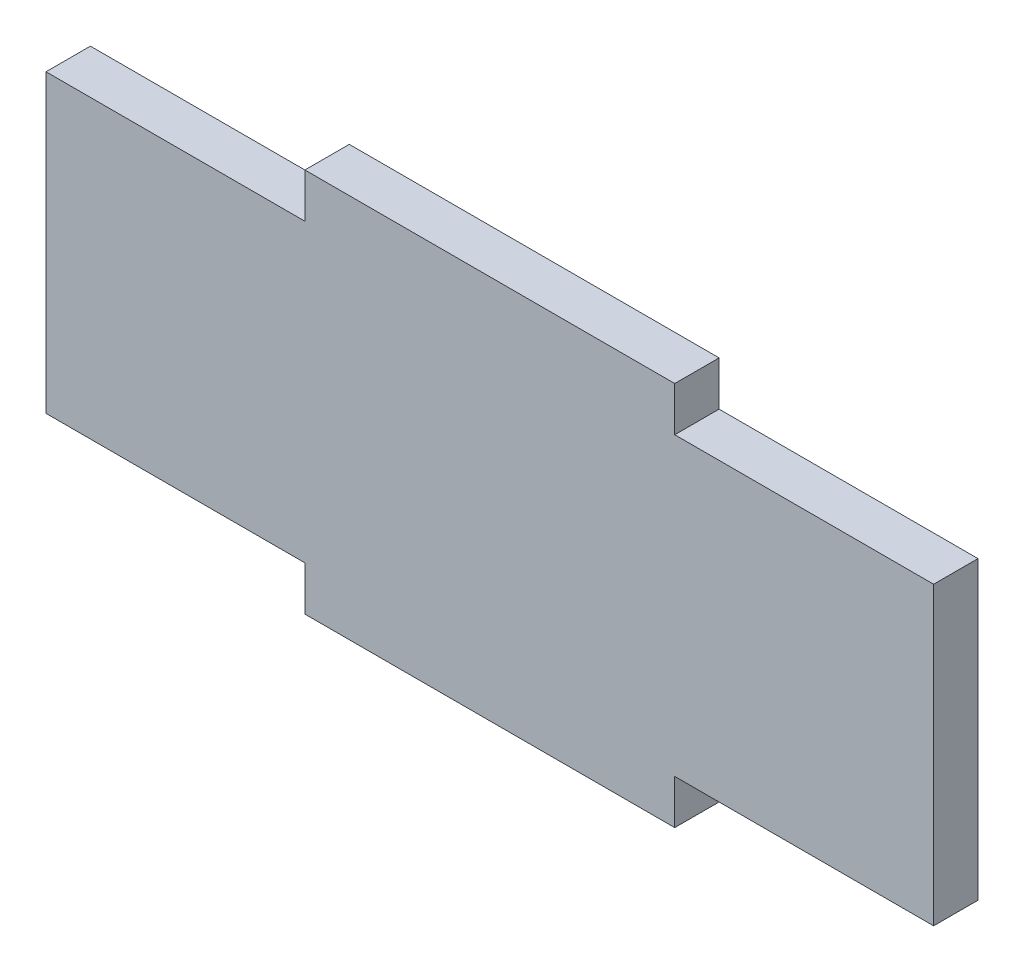
ISO-10303-21;
HEADER;
FILE_DESCRIPTION(('STEP AP214'),'2;1');
FILE_NAME('part.step','',(''),(''),'','','');
FILE_SCHEMA(('AUTOMOTIVE_DESIGN { 1 0 10303 214 1 1 1 1 }'));
ENDSEC;
DATA;
#1=APPLICATION_CONTEXT('core data for automotive mechanical design processes');
#2=APPLICATION_PROTOCOL_DEFINITION('international standard','automotive_design',2000,#1);
#3=PRODUCT_CONTEXT('',#1,'mechanical');
#4=PRODUCT('Part','Part','',(#3));
#5=PRODUCT_RELATED_PRODUCT_CATEGORY('part','',(#4));
#6=PRODUCT_DEFINITION_FORMATION('','',#4);
#7=PRODUCT_DEFINITION_CONTEXT('part definition',#1,'design');
#8=PRODUCT_DEFINITION('design','',#6,#7);
#9=PRODUCT_DEFINITION_SHAPE('','',#8);
#10=(LENGTH_UNIT() NAMED_UNIT(*) SI_UNIT(.MILLI.,.METRE.));
#11=(NAMED_UNIT(*) PLANE_ANGLE_UNIT() SI_UNIT($,.RADIAN.));
#12=(NAMED_UNIT(*) SI_UNIT($,.STERADIAN.) SOLID_ANGLE_UNIT());
#13=UNCERTAINTY_MEASURE_WITH_UNIT(LENGTH_MEASURE(1.E-05),#10,'distance_accuracy_value','');
#14=(GEOMETRIC_REPRESENTATION_CONTEXT(3) GLOBAL_UNCERTAINTY_ASSIGNED_CONTEXT((#13)) GLOBAL_UNIT_ASSIGNED_CONTEXT((#10,
#11,#12)) REPRESENTATION_CONTEXT('',''));
#15=CARTESIAN_POINT('',(0.,0.,0.));
#16=DIRECTION('',(0.,0.,1.));
#17=DIRECTION('',(1.,0.,0.));
#18=AXIS2_PLACEMENT_3D('',#15,#16,#17);
#19=CARTESIAN_POINT('',(60.,-20.,6.));
#20=DIRECTION('',(0.,1.,0.));
#21=DIRECTION('',(-1.,0.,0.));
#22=AXIS2_PLACEMENT_3D('',#19,#20,#21);
#23=PLANE('',#22);
#24=DIRECTION('',(0.,0.,1.));
#25=VECTOR('',#24,1.);
#26=CARTESIAN_POINT('',(25.,-20.,0.));
#27=LINE('',#26,#25);
#28=CARTESIAN_POINT('',(25.,-20.,0.));
#29=VERTEX_POINT('',#28);
#30=CARTESIAN_POINT('',(25.,-20.,6.));
#31=VERTEX_POINT('',#30);
#32=EDGE_CURVE('E154',#29,#31,#27,.T.);
#33=ORIENTED_EDGE('',*,*,#32,.F.);
#34=DIRECTION('',(1.,0.,0.));
#35=VECTOR('',#34,1.);
#36=CARTESIAN_POINT('',(60.,-20.,0.));
#37=LINE('',#36,#35);
#38=CARTESIAN_POINT('',(60.,-20.,0.));
#39=VERTEX_POINT('',#38);
#40=EDGE_CURVE('E197',#29,#39,#37,.T.);
#41=ORIENTED_EDGE('',*,*,#40,.T.);
#42=DIRECTION('',(0.,0.,-1.));
#43=VECTOR('',#42,1.);
#44=CARTESIAN_POINT('',(60.,-20.,6.));
#45=LINE('',#44,#43);
#46=CARTESIAN_POINT('',(60.,-20.,6.));
#47=VERTEX_POINT('',#46);
#48=EDGE_CURVE('E42',#47,#39,#45,.T.);
#49=ORIENTED_EDGE('',*,*,#48,.F.);
#50=DIRECTION('',(1.,0.,0.));
#51=VECTOR('',#50,1.);
#52=CARTESIAN_POINT('',(60.,-20.,6.));
#53=LINE('',#52,#51);
#54=EDGE_CURVE('E183',#31,#47,#53,.T.);
#55=ORIENTED_EDGE('',*,*,#54,.F.);
#56=EDGE_LOOP('',(#33,#41,#49,#55));
#57=FACE_BOUND('',#56,.T.);
#58=ADVANCED_FACE('F34',(#57),#23,.F.);
#59=CARTESIAN_POINT('',(60.,20.,6.));
#60=DIRECTION('',(0.,-1.,0.));
#61=DIRECTION('',(1.,0.,0.));
#62=AXIS2_PLACEMENT_3D('',#59,#60,#61);
#63=PLANE('',#62);
#64=DIRECTION('',(0.,0.,1.));
#65=VECTOR('',#64,1.);
#66=CARTESIAN_POINT('',(-25.,20.,0.));
#67=LINE('',#66,#65);
#68=CARTESIAN_POINT('',(-25.,20.,0.));
#69=VERTEX_POINT('',#68);
#70=CARTESIAN_POINT('',(-25.,20.,6.));
#71=VERTEX_POINT('',#70);
#72=EDGE_CURVE('E166',#69,#71,#67,.T.);
#73=ORIENTED_EDGE('',*,*,#72,.F.);
#74=DIRECTION('',(-1.,0.,0.));
#75=VECTOR('',#74,1.);
#76=CARTESIAN_POINT('',(60.,20.,0.));
#77=LINE('',#76,#75);
#78=CARTESIAN_POINT('',(-60.,20.,0.));
#79=VERTEX_POINT('',#78);
#80=EDGE_CURVE('E202',#69,#79,#77,.T.);
#81=ORIENTED_EDGE('',*,*,#80,.T.);
#82=DIRECTION('',(0.,0.,-1.));
#83=VECTOR('',#82,1.);
#84=CARTESIAN_POINT('',(-60.,20.,6.));
#85=LINE('',#84,#83);
#86=CARTESIAN_POINT('',(-60.,20.,6.));
#87=VERTEX_POINT('',#86);
#88=EDGE_CURVE('E194',#87,#79,#85,.T.);
#89=ORIENTED_EDGE('',*,*,#88,.F.);
#90=DIRECTION('',(-1.,0.,0.));
#91=VECTOR('',#90,1.);
#92=CARTESIAN_POINT('',(60.,20.,6.));
#93=LINE('',#92,#91);
#94=EDGE_CURVE('E190',#71,#87,#93,.T.);
#95=ORIENTED_EDGE('',*,*,#94,.F.);
#96=EDGE_LOOP('',(#73,#81,#89,#95));
#97=FACE_BOUND('',#96,.T.);
#98=ADVANCED_FACE('F242',(#97),#63,.F.);
#99=CARTESIAN_POINT('',(-60.,20.,6.));
#100=DIRECTION('',(1.,0.,0.));
#101=DIRECTION('',(0.,1.,0.));
#102=AXIS2_PLACEMENT_3D('',#99,#100,#101);
#103=PLANE('',#102);
#104=DIRECTION('',(0.,-1.,0.));
#105=VECTOR('',#104,1.);
#106=CARTESIAN_POINT('',(-60.,20.,0.));
#107=LINE('',#106,#105);
#108=CARTESIAN_POINT('',(-60.,-20.,0.));
#109=VERTEX_POINT('',#108);
#110=EDGE_CURVE('E174',#79,#109,#107,.T.);
#111=ORIENTED_EDGE('',*,*,#110,.T.);
#112=DIRECTION('',(0.,0.,-1.));
#113=VECTOR('',#112,1.);
#114=CARTESIAN_POINT('',(-60.,-20.,6.));
#115=LINE('',#114,#113);
#116=CARTESIAN_POINT('',(-60.,-20.,6.));
#117=VERTEX_POINT('',#116);
#118=EDGE_CURVE('E11',#117,#109,#115,.T.);
#119=ORIENTED_EDGE('',*,*,#118,.F.);
#120=DIRECTION('',(0.,-1.,0.));
#121=VECTOR('',#120,1.);
#122=CARTESIAN_POINT('',(-60.,20.,6.));
#123=LINE('',#122,#121);
#124=EDGE_CURVE('E180',#87,#117,#123,.T.);
#125=ORIENTED_EDGE('',*,*,#124,.F.);
#126=ORIENTED_EDGE('',*,*,#88,.T.);
#127=EDGE_LOOP('',(#111,#119,#125,#126));
#128=FACE_BOUND('',#127,.T.);
#129=ADVANCED_FACE('F36',(#128),#103,.F.);
#130=CARTESIAN_POINT('',(-25.,-20.,0.));
#131=VERTEX_POINT('',#130);
#132=EDGE_CURVE('E198',#109,#131,#37,.T.);
#133=ORIENTED_EDGE('',*,*,#132,.T.);
#134=DIRECTION('',(0.,0.,1.));
#135=VECTOR('',#134,1.);
#136=CARTESIAN_POINT('',(-25.,-20.,0.));
#137=LINE('',#136,#135);
#138=CARTESIAN_POINT('',(-25.,-20.,6.));
#139=VERTEX_POINT('',#138);
#140=EDGE_CURVE('E143',#131,#139,#137,.T.);
#141=ORIENTED_EDGE('',*,*,#140,.T.);
#142=EDGE_CURVE('E185',#117,#139,#53,.T.);
#143=ORIENTED_EDGE('',*,*,#142,.F.);
#144=ORIENTED_EDGE('',*,*,#118,.T.);
#145=EDGE_LOOP('',(#133,#141,#143,#144));
#146=FACE_BOUND('',#145,.T.);
#147=ADVANCED_FACE('F234',(#146),#23,.F.);
#148=CARTESIAN_POINT('',(60.,20.,6.));
#149=DIRECTION('',(-1.,0.,0.));
#150=DIRECTION('',(0.,-1.,0.));
#151=AXIS2_PLACEMENT_3D('',#148,#149,#150);
#152=PLANE('',#151);
#153=DIRECTION('',(0.,1.,0.));
#154=VECTOR('',#153,1.);
#155=CARTESIAN_POINT('',(60.,20.,0.));
#156=LINE('',#155,#154);
#157=CARTESIAN_POINT('',(60.,20.,0.));
#158=VERTEX_POINT('',#157);
#159=EDGE_CURVE('E200',#39,#158,#156,.T.);
#160=ORIENTED_EDGE('',*,*,#159,.T.);
#161=DIRECTION('',(0.,0.,-1.));
#162=VECTOR('',#161,1.);
#163=CARTESIAN_POINT('',(60.,20.,6.));
#164=LINE('',#163,#162);
#165=CARTESIAN_POINT('',(60.,20.,6.));
#166=VERTEX_POINT('',#165);
#167=EDGE_CURVE('E207',#166,#158,#164,.T.);
#168=ORIENTED_EDGE('',*,*,#167,.F.);
#169=DIRECTION('',(0.,1.,0.));
#170=VECTOR('',#169,1.);
#171=CARTESIAN_POINT('',(60.,20.,6.));
#172=LINE('',#171,#170);
#173=EDGE_CURVE('E188',#47,#166,#172,.T.);
#174=ORIENTED_EDGE('',*,*,#173,.F.);
#175=ORIENTED_EDGE('',*,*,#48,.T.);
#176=EDGE_LOOP('',(#160,#168,#174,#175));
#177=FACE_BOUND('',#176,.T.);
#178=ADVANCED_FACE('F214',(#177),#152,.F.);
#179=CARTESIAN_POINT('',(25.,20.,0.));
#180=VERTEX_POINT('',#179);
#181=EDGE_CURVE('E184',#158,#180,#77,.T.);
#182=ORIENTED_EDGE('',*,*,#181,.T.);
#183=DIRECTION('',(0.,0.,1.));
#184=VECTOR('',#183,1.);
#185=CARTESIAN_POINT('',(25.,20.,0.));
#186=LINE('',#185,#184);
#187=CARTESIAN_POINT('',(25.,20.,6.));
#188=VERTEX_POINT('',#187);
#189=EDGE_CURVE('E177',#180,#188,#186,.T.);
#190=ORIENTED_EDGE('',*,*,#189,.T.);
#191=EDGE_CURVE('E191',#166,#188,#93,.T.);
#192=ORIENTED_EDGE('',*,*,#191,.F.);
#193=ORIENTED_EDGE('',*,*,#167,.T.);
#194=EDGE_LOOP('',(#182,#190,#192,#193));
#195=FACE_BOUND('',#194,.T.);
#196=ADVANCED_FACE('F222',(#195),#63,.F.);
#197=CARTESIAN_POINT('',(0.,0.,6.));
#198=DIRECTION('',(0.,0.,-1.));
#199=DIRECTION('',(-1.,0.,0.));
#200=AXIS2_PLACEMENT_3D('',#197,#198,#199);
#201=PLANE('',#200);
#202=ORIENTED_EDGE('',*,*,#124,.T.);
#203=ORIENTED_EDGE('',*,*,#142,.T.);
#204=DIRECTION('',(0.,-1.,0.));
#205=VECTOR('',#204,1.);
#206=CARTESIAN_POINT('',(-25.,-20.,6.));
#207=LINE('',#206,#205);
#208=CARTESIAN_POINT('',(-25.,-26.,6.));
#209=VERTEX_POINT('',#208);
#210=EDGE_CURVE('E49',#139,#209,#207,.T.);
#211=ORIENTED_EDGE('',*,*,#210,.T.);
#212=DIRECTION('',(1.,0.,0.));
#213=VECTOR('',#212,1.);
#214=CARTESIAN_POINT('',(-25.,-26.,6.));
#215=LINE('',#214,#213);
#216=CARTESIAN_POINT('',(25.,-26.,6.));
#217=VERTEX_POINT('',#216);
#218=EDGE_CURVE('E128',#209,#217,#215,.T.);
#219=ORIENTED_EDGE('',*,*,#218,.T.);
#220=DIRECTION('',(0.,1.,0.));
#221=VECTOR('',#220,1.);
#222=CARTESIAN_POINT('',(25.,-20.,6.));
#223=LINE('',#222,#221);
#224=EDGE_CURVE('E144',#217,#31,#223,.T.);
#225=ORIENTED_EDGE('',*,*,#224,.T.);
#226=ORIENTED_EDGE('',*,*,#54,.T.);
#227=ORIENTED_EDGE('',*,*,#173,.T.);
#228=ORIENTED_EDGE('',*,*,#191,.T.);
#229=DIRECTION('',(0.,1.,0.));
#230=VECTOR('',#229,1.);
#231=CARTESIAN_POINT('',(25.,20.,6.));
#232=LINE('',#231,#230);
#233=CARTESIAN_POINT('',(25.,26.,6.));
#234=VERTEX_POINT('',#233);
#235=EDGE_CURVE('E57',#188,#234,#232,.T.);
#236=ORIENTED_EDGE('',*,*,#235,.T.);
#237=DIRECTION('',(-1.,0.,0.));
#238=VECTOR('',#237,1.);
#239=CARTESIAN_POINT('',(-25.,26.,6.));
#240=LINE('',#239,#238);
#241=CARTESIAN_POINT('',(-25.,26.,6.));
#242=VERTEX_POINT('',#241);
#243=EDGE_CURVE('E160',#234,#242,#240,.T.);
#244=ORIENTED_EDGE('',*,*,#243,.T.);
#245=DIRECTION('',(0.,-1.,0.));
#246=VECTOR('',#245,1.);
#247=CARTESIAN_POINT('',(-25.,20.,6.));
#248=LINE('',#247,#246);
#249=EDGE_CURVE('E153',#242,#71,#248,.T.);
#250=ORIENTED_EDGE('',*,*,#249,.T.);
#251=ORIENTED_EDGE('',*,*,#94,.T.);
#252=EDGE_LOOP('',(#202,#203,#211,#219,#225,#226,#227,#228,#236,#244,#250,#251));
#253=FACE_BOUND('',#252,.T.);
#254=ADVANCED_FACE('F225',(#253),#201,.F.);
#255=CARTESIAN_POINT('',(0.,0.,0.));
#256=DIRECTION('',(0.,0.,-1.));
#257=DIRECTION('',(-1.,0.,0.));
#258=AXIS2_PLACEMENT_3D('',#255,#256,#257);
#259=PLANE('',#258);
#260=ORIENTED_EDGE('',*,*,#110,.F.);
#261=ORIENTED_EDGE('',*,*,#80,.F.);
#262=DIRECTION('',(0.,-1.,0.));
#263=VECTOR('',#262,1.);
#264=CARTESIAN_POINT('',(-25.,20.,0.));
#265=LINE('',#264,#263);
#266=CARTESIAN_POINT('',(-25.,26.,0.));
#267=VERTEX_POINT('',#266);
#268=EDGE_CURVE('E157',#267,#69,#265,.T.);
#269=ORIENTED_EDGE('',*,*,#268,.F.);
#270=DIRECTION('',(-1.,0.,0.));
#271=VECTOR('',#270,1.);
#272=CARTESIAN_POINT('',(-25.,26.,0.));
#273=LINE('',#272,#271);
#274=CARTESIAN_POINT('',(25.,26.,0.));
#275=VERTEX_POINT('',#274);
#276=EDGE_CURVE('E163',#275,#267,#273,.T.);
#277=ORIENTED_EDGE('',*,*,#276,.F.);
#278=DIRECTION('',(0.,1.,0.));
#279=VECTOR('',#278,1.);
#280=CARTESIAN_POINT('',(25.,20.,0.));
#281=LINE('',#280,#279);
#282=EDGE_CURVE('E159',#180,#275,#281,.T.);
#283=ORIENTED_EDGE('',*,*,#282,.F.);
#284=ORIENTED_EDGE('',*,*,#181,.F.);
#285=ORIENTED_EDGE('',*,*,#159,.F.);
#286=ORIENTED_EDGE('',*,*,#40,.F.);
#287=DIRECTION('',(0.,1.,0.));
#288=VECTOR('',#287,1.);
#289=CARTESIAN_POINT('',(25.,-20.,0.));
#290=LINE('',#289,#288);
#291=CARTESIAN_POINT('',(25.,-26.,0.));
#292=VERTEX_POINT('',#291);
#293=EDGE_CURVE('E131',#292,#29,#290,.T.);
#294=ORIENTED_EDGE('',*,*,#293,.F.);
#295=DIRECTION('',(1.,0.,0.));
#296=VECTOR('',#295,1.);
#297=CARTESIAN_POINT('',(-25.,-26.,0.));
#298=LINE('',#297,#296);
#299=CARTESIAN_POINT('',(-25.,-26.,0.));
#300=VERTEX_POINT('',#299);
#301=EDGE_CURVE('E126',#300,#292,#298,.T.);
#302=ORIENTED_EDGE('',*,*,#301,.F.);
#303=DIRECTION('',(0.,-1.,0.));
#304=VECTOR('',#303,1.);
#305=CARTESIAN_POINT('',(-25.,-20.,0.));
#306=LINE('',#305,#304);
#307=EDGE_CURVE('E138',#131,#300,#306,.T.);
#308=ORIENTED_EDGE('',*,*,#307,.F.);
#309=ORIENTED_EDGE('',*,*,#132,.F.);
#310=EDGE_LOOP('',(#260,#261,#269,#277,#283,#284,#285,#286,#294,#302,#308,#309));
#311=FACE_BOUND('',#310,.T.);
#312=ADVANCED_FACE('F137',(#311),#259,.T.);
#313=CARTESIAN_POINT('',(-25.,20.,0.));
#314=DIRECTION('',(-1.,0.,0.));
#315=DIRECTION('',(0.,-1.,0.));
#316=AXIS2_PLACEMENT_3D('',#313,#314,#315);
#317=PLANE('',#316);
#318=ORIENTED_EDGE('',*,*,#249,.F.);
#319=DIRECTION('',(0.,0.,1.));
#320=VECTOR('',#319,1.);
#321=CARTESIAN_POINT('',(-25.,26.,0.));
#322=LINE('',#321,#320);
#323=EDGE_CURVE('E172',#267,#242,#322,.T.);
#324=ORIENTED_EDGE('',*,*,#323,.F.);
#325=ORIENTED_EDGE('',*,*,#268,.T.);
#326=ORIENTED_EDGE('',*,*,#72,.T.);
#327=EDGE_LOOP('',(#318,#324,#325,#326));
#328=FACE_BOUND('',#327,.T.);
#329=ADVANCED_FACE('F245',(#328),#317,.T.);
#330=CARTESIAN_POINT('',(-25.,26.,0.));
#331=DIRECTION('',(0.,1.,0.));
#332=DIRECTION('',(0.,0.,1.));
#333=AXIS2_PLACEMENT_3D('',#330,#331,#332);
#334=PLANE('',#333);
#335=ORIENTED_EDGE('',*,*,#243,.F.);
#336=DIRECTION('',(0.,0.,1.));
#337=VECTOR('',#336,1.);
#338=CARTESIAN_POINT('',(25.,26.,0.));
#339=LINE('',#338,#337);
#340=EDGE_CURVE('E175',#275,#234,#339,.T.);
#341=ORIENTED_EDGE('',*,*,#340,.F.);
#342=ORIENTED_EDGE('',*,*,#276,.T.);
#343=ORIENTED_EDGE('',*,*,#323,.T.);
#344=EDGE_LOOP('',(#335,#341,#342,#343));
#345=FACE_BOUND('',#344,.T.);
#346=ADVANCED_FACE('F247',(#345),#334,.T.);
#347=CARTESIAN_POINT('',(25.,20.,0.));
#348=DIRECTION('',(1.,0.,0.));
#349=DIRECTION('',(0.,0.,-1.));
#350=AXIS2_PLACEMENT_3D('',#347,#348,#349);
#351=PLANE('',#350);
#352=ORIENTED_EDGE('',*,*,#235,.F.);
#353=ORIENTED_EDGE('',*,*,#189,.F.);
#354=ORIENTED_EDGE('',*,*,#282,.T.);
#355=ORIENTED_EDGE('',*,*,#340,.T.);
#356=EDGE_LOOP('',(#352,#353,#354,#355));
#357=FACE_BOUND('',#356,.T.);
#358=ADVANCED_FACE('F248',(#357),#351,.T.);
#359=CARTESIAN_POINT('',(-25.,-20.,0.));
#360=DIRECTION('',(-1.,0.,0.));
#361=DIRECTION('',(0.,-1.,0.));
#362=AXIS2_PLACEMENT_3D('',#359,#360,#361);
#363=PLANE('',#362);
#364=ORIENTED_EDGE('',*,*,#210,.F.);
#365=ORIENTED_EDGE('',*,*,#140,.F.);
#366=ORIENTED_EDGE('',*,*,#307,.T.);
#367=DIRECTION('',(0.,0.,1.));
#368=VECTOR('',#367,1.);
#369=CARTESIAN_POINT('',(-25.,-26.,0.));
#370=LINE('',#369,#368);
#371=EDGE_CURVE('E123',#300,#209,#370,.T.);
#372=ORIENTED_EDGE('',*,*,#371,.T.);
#373=EDGE_LOOP('',(#364,#365,#366,#372));
#374=FACE_BOUND('',#373,.T.);
#375=ADVANCED_FACE('F142',(#374),#363,.T.);
#376=CARTESIAN_POINT('',(25.,-20.,0.));
#377=DIRECTION('',(1.,0.,0.));
#378=DIRECTION('',(0.,0.,-1.));
#379=AXIS2_PLACEMENT_3D('',#376,#377,#378);
#380=PLANE('',#379);
#381=ORIENTED_EDGE('',*,*,#224,.F.);
#382=DIRECTION('',(0.,0.,1.));
#383=VECTOR('',#382,1.);
#384=CARTESIAN_POINT('',(25.,-26.,0.));
#385=LINE('',#384,#383);
#386=EDGE_CURVE('E130',#292,#217,#385,.T.);
#387=ORIENTED_EDGE('',*,*,#386,.F.);
#388=ORIENTED_EDGE('',*,*,#293,.T.);
#389=ORIENTED_EDGE('',*,*,#32,.T.);
#390=EDGE_LOOP('',(#381,#387,#388,#389));
#391=FACE_BOUND('',#390,.T.);
#392=ADVANCED_FACE('F230',(#391),#380,.T.);
#393=CARTESIAN_POINT('',(-25.,-26.,0.));
#394=DIRECTION('',(0.,-1.,0.));
#395=DIRECTION('',(0.,0.,-1.));
#396=AXIS2_PLACEMENT_3D('',#393,#394,#395);
#397=PLANE('',#396);
#398=ORIENTED_EDGE('',*,*,#218,.F.);
#399=ORIENTED_EDGE('',*,*,#371,.F.);
#400=ORIENTED_EDGE('',*,*,#301,.T.);
#401=ORIENTED_EDGE('',*,*,#386,.T.);
#402=EDGE_LOOP('',(#398,#399,#400,#401));
#403=FACE_BOUND('',#402,.T.);
#404=ADVANCED_FACE('F125',(#403),#397,.T.);
#405=CLOSED_SHELL('',(#58,#98,#129,#147,#178,#196,#254,#312,#329,#346,#358,#375,#392,#404));
#406=MANIFOLD_SOLID_BREP('B2',#405);
#407=ADVANCED_BREP_SHAPE_REPRESENTATION('',(#18,#406),#14);
#408=SHAPE_DEFINITION_REPRESENTATION(#9,#407);
ENDSEC;
END-ISO-10303-21;
